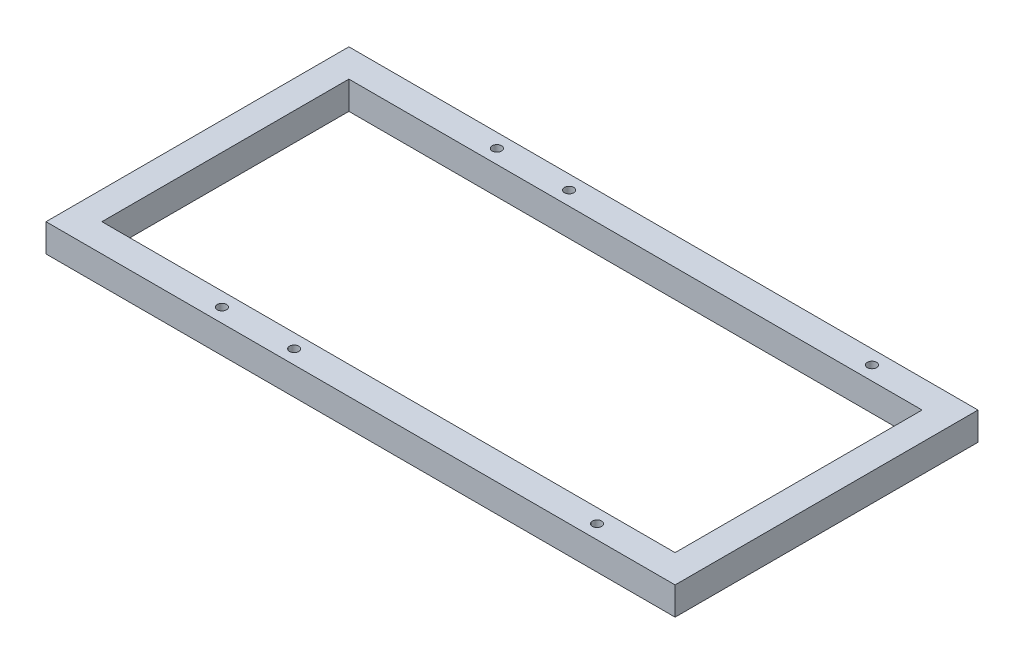
ISO-10303-21;
HEADER;
FILE_DESCRIPTION(('STEP AP214'),'2;1');
FILE_NAME('part.step','',(''),(''),'','','');
FILE_SCHEMA(('AUTOMOTIVE_DESIGN { 1 0 10303 214 1 1 1 1 }'));
ENDSEC;
DATA;
#1=APPLICATION_CONTEXT('core data for automotive mechanical design processes');
#2=APPLICATION_PROTOCOL_DEFINITION('international standard','automotive_design',2000,#1);
#3=PRODUCT_CONTEXT('',#1,'mechanical');
#4=PRODUCT('Part','Part','',(#3));
#5=PRODUCT_RELATED_PRODUCT_CATEGORY('part','',(#4));
#6=PRODUCT_DEFINITION_FORMATION('','',#4);
#7=PRODUCT_DEFINITION_CONTEXT('part definition',#1,'design');
#8=PRODUCT_DEFINITION('design','',#6,#7);
#9=PRODUCT_DEFINITION_SHAPE('','',#8);
#10=(LENGTH_UNIT() NAMED_UNIT(*) SI_UNIT(.MILLI.,.METRE.));
#11=(NAMED_UNIT(*) PLANE_ANGLE_UNIT() SI_UNIT($,.RADIAN.));
#12=(NAMED_UNIT(*) SI_UNIT($,.STERADIAN.) SOLID_ANGLE_UNIT());
#13=UNCERTAINTY_MEASURE_WITH_UNIT(LENGTH_MEASURE(1.E-05),#10,'distance_accuracy_value','');
#14=(GEOMETRIC_REPRESENTATION_CONTEXT(3) GLOBAL_UNCERTAINTY_ASSIGNED_CONTEXT((#13)) GLOBAL_UNIT_ASSIGNED_CONTEXT((#10,
#11,#12)) REPRESENTATION_CONTEXT('',''));
#15=CARTESIAN_POINT('',(0.,0.,0.));
#16=DIRECTION('',(0.,0.,1.));
#17=DIRECTION('',(1.,0.,0.));
#18=AXIS2_PLACEMENT_3D('',#15,#16,#17);
#19=CARTESIAN_POINT('',(0.,12.,0.));
#20=DIRECTION('',(0.,1.,0.));
#21=DIRECTION('',(0.,0.,1.));
#22=AXIS2_PLACEMENT_3D('',#19,#20,#21);
#23=PLANE('',#22);
#24=CARTESIAN_POINT('',(95.4999999999999,12.,-59.));
#25=DIRECTION('',(0.,-1.,0.));
#26=DIRECTION('',(0.,0.,-1.));
#27=AXIS2_PLACEMENT_3D('',#24,#25,#26);
#28=CIRCLE('',#27,2.);
#29=CARTESIAN_POINT('',(95.4999999999999,12.,-61.));
#30=VERTEX_POINT('',#29);
#31=EDGE_CURVE('E191',#30,#30,#28,.T.);
#32=ORIENTED_EDGE('',*,*,#31,.T.);
#33=EDGE_LOOP('',(#32));
#34=FACE_BOUND('',#33,.T.);
#35=CARTESIAN_POINT('',(95.4999999999999,12.,59.));
#36=DIRECTION('',(0.,1.,0.));
#37=DIRECTION('',(0.,0.,1.));
#38=AXIS2_PLACEMENT_3D('',#35,#36,#37);
#39=CIRCLE('',#38,2.);
#40=CARTESIAN_POINT('',(95.4999999999999,12.,61.));
#41=VERTEX_POINT('',#40);
#42=EDGE_CURVE('E181',#41,#41,#39,.T.);
#43=ORIENTED_EDGE('',*,*,#42,.F.);
#44=EDGE_LOOP('',(#43));
#45=FACE_BOUND('',#44,.T.);
#46=CARTESIAN_POINT('',(-34.5000000000001,12.,59.));
#47=DIRECTION('',(0.,1.,0.));
#48=DIRECTION('',(0.,0.,1.));
#49=AXIS2_PLACEMENT_3D('',#46,#47,#48);
#50=CIRCLE('',#49,2.);
#51=CARTESIAN_POINT('',(-34.5000000000001,12.,61.));
#52=VERTEX_POINT('',#51);
#53=EDGE_CURVE('E178',#52,#52,#50,.T.);
#54=ORIENTED_EDGE('',*,*,#53,.F.);
#55=EDGE_LOOP('',(#54));
#56=FACE_BOUND('',#55,.T.);
#57=CARTESIAN_POINT('',(-34.5000000000001,12.,-59.));
#58=DIRECTION('',(0.,-1.,0.));
#59=DIRECTION('',(0.,0.,-1.));
#60=AXIS2_PLACEMENT_3D('',#57,#58,#59);
#61=CIRCLE('',#60,2.);
#62=CARTESIAN_POINT('',(-34.5000000000001,12.,-61.));
#63=VERTEX_POINT('',#62);
#64=EDGE_CURVE('E175',#63,#63,#61,.T.);
#65=ORIENTED_EDGE('',*,*,#64,.T.);
#66=EDGE_LOOP('',(#65));
#67=FACE_BOUND('',#66,.T.);
#68=CARTESIAN_POINT('',(-65.5000000000001,12.,-59.));
#69=DIRECTION('',(0.,-1.,0.));
#70=DIRECTION('',(0.,0.,-1.));
#71=AXIS2_PLACEMENT_3D('',#68,#69,#70);
#72=CIRCLE('',#71,2.);
#73=CARTESIAN_POINT('',(-65.5000000000001,12.,-61.));
#74=VERTEX_POINT('',#73);
#75=EDGE_CURVE('E171',#74,#74,#72,.T.);
#76=ORIENTED_EDGE('',*,*,#75,.T.);
#77=EDGE_LOOP('',(#76));
#78=FACE_BOUND('',#77,.T.);
#79=CARTESIAN_POINT('',(-65.5000000000001,12.,59.));
#80=DIRECTION('',(0.,1.,0.));
#81=DIRECTION('',(0.,0.,1.));
#82=AXIS2_PLACEMENT_3D('',#79,#80,#81);
#83=CIRCLE('',#82,2.);
#84=CARTESIAN_POINT('',(-65.5000000000001,12.,61.));
#85=VERTEX_POINT('',#84);
#86=EDGE_CURVE('E167',#85,#85,#83,.T.);
#87=ORIENTED_EDGE('',*,*,#86,.F.);
#88=EDGE_LOOP('',(#87));
#89=FACE_BOUND('',#88,.T.);
#90=DIRECTION('',(0.,0.,-1.));
#91=VECTOR('',#90,1.);
#92=CARTESIAN_POINT('',(135.,12.,-65.));
#93=LINE('',#92,#91);
#94=CARTESIAN_POINT('',(135.,12.,65.));
#95=VERTEX_POINT('',#94);
#96=CARTESIAN_POINT('',(135.,12.,-65.));
#97=VERTEX_POINT('',#96);
#98=EDGE_CURVE('E140',#95,#97,#93,.T.);
#99=ORIENTED_EDGE('',*,*,#98,.T.);
#100=DIRECTION('',(-1.,0.,0.));
#101=VECTOR('',#100,1.);
#102=CARTESIAN_POINT('',(-135.,12.,-65.));
#103=LINE('',#102,#101);
#104=CARTESIAN_POINT('',(-135.,12.,-65.));
#105=VERTEX_POINT('',#104);
#106=EDGE_CURVE('E143',#97,#105,#103,.T.);
#107=ORIENTED_EDGE('',*,*,#106,.T.);
#108=DIRECTION('',(0.,0.,1.));
#109=VECTOR('',#108,1.);
#110=CARTESIAN_POINT('',(-135.,12.,-65.));
#111=LINE('',#110,#109);
#112=CARTESIAN_POINT('',(-135.,12.,65.));
#113=VERTEX_POINT('',#112);
#114=EDGE_CURVE('E146',#105,#113,#111,.T.);
#115=ORIENTED_EDGE('',*,*,#114,.T.);
#116=DIRECTION('',(1.,0.,0.));
#117=VECTOR('',#116,1.);
#118=CARTESIAN_POINT('',(-135.,12.,65.));
#119=LINE('',#118,#117);
#120=EDGE_CURVE('E148',#113,#95,#119,.T.);
#121=ORIENTED_EDGE('',*,*,#120,.T.);
#122=EDGE_LOOP('',(#99,#107,#115,#121));
#123=FACE_BOUND('',#122,.T.);
#124=DIRECTION('',(-1.,0.,0.));
#125=VECTOR('',#124,1.);
#126=CARTESIAN_POINT('',(-123.,12.,-53.));
#127=LINE('',#126,#125);
#128=CARTESIAN_POINT('',(123.,12.,-53.));
#129=VERTEX_POINT('',#128);
#130=CARTESIAN_POINT('',(-123.,12.,-53.));
#131=VERTEX_POINT('',#130);
#132=EDGE_CURVE('E110',#129,#131,#127,.T.);
#133=ORIENTED_EDGE('',*,*,#132,.F.);
#134=DIRECTION('',(0.,0.,-1.));
#135=VECTOR('',#134,1.);
#136=CARTESIAN_POINT('',(123.,12.,-53.));
#137=LINE('',#136,#135);
#138=CARTESIAN_POINT('',(123.,12.,53.));
#139=VERTEX_POINT('',#138);
#140=EDGE_CURVE('E102',#139,#129,#137,.T.);
#141=ORIENTED_EDGE('',*,*,#140,.F.);
#142=DIRECTION('',(1.,0.,0.));
#143=VECTOR('',#142,1.);
#144=CARTESIAN_POINT('',(-123.,12.,53.));
#145=LINE('',#144,#143);
#146=CARTESIAN_POINT('',(-123.,12.,53.));
#147=VERTEX_POINT('',#146);
#148=EDGE_CURVE('E124',#147,#139,#145,.T.);
#149=ORIENTED_EDGE('',*,*,#148,.F.);
#150=DIRECTION('',(0.,0.,1.));
#151=VECTOR('',#150,1.);
#152=CARTESIAN_POINT('',(-123.,12.,-53.));
#153=LINE('',#152,#151);
#154=EDGE_CURVE('E122',#131,#147,#153,.T.);
#155=ORIENTED_EDGE('',*,*,#154,.F.);
#156=EDGE_LOOP('',(#133,#141,#149,#155));
#157=FACE_BOUND('',#156,.T.);
#158=ADVANCED_FACE('F35',(#34,#45,#56,#67,#78,#89,#123,#157),#23,.T.);
#159=CARTESIAN_POINT('',(0.,0.,0.));
#160=DIRECTION('',(0.,1.,0.));
#161=DIRECTION('',(0.,0.,1.));
#162=AXIS2_PLACEMENT_3D('',#159,#160,#161);
#163=PLANE('',#162);
#164=CARTESIAN_POINT('',(95.4999999999999,0.,-59.));
#165=DIRECTION('',(0.,1.,0.));
#166=DIRECTION('',(0.,0.,1.));
#167=AXIS2_PLACEMENT_3D('',#164,#165,#166);
#168=CIRCLE('',#167,2.);
#169=CARTESIAN_POINT('',(95.4999999999999,0.,-57.));
#170=VERTEX_POINT('',#169);
#171=EDGE_CURVE('E39',#170,#170,#168,.F.);
#172=ORIENTED_EDGE('',*,*,#171,.F.);
#173=EDGE_LOOP('',(#172));
#174=FACE_BOUND('',#173,.T.);
#175=CARTESIAN_POINT('',(95.4999999999999,0.,59.));
#176=DIRECTION('',(0.,1.,0.));
#177=DIRECTION('',(0.,0.,1.));
#178=AXIS2_PLACEMENT_3D('',#175,#176,#177);
#179=CIRCLE('',#178,2.);
#180=CARTESIAN_POINT('',(95.4999999999999,0.,61.));
#181=VERTEX_POINT('',#180);
#182=EDGE_CURVE('E179',#181,#181,#179,.T.);
#183=ORIENTED_EDGE('',*,*,#182,.T.);
#184=EDGE_LOOP('',(#183));
#185=FACE_BOUND('',#184,.T.);
#186=CARTESIAN_POINT('',(-34.5000000000001,0.,59.));
#187=DIRECTION('',(0.,1.,0.));
#188=DIRECTION('',(0.,0.,1.));
#189=AXIS2_PLACEMENT_3D('',#186,#187,#188);
#190=CIRCLE('',#189,2.);
#191=CARTESIAN_POINT('',(-34.5000000000001,0.,61.));
#192=VERTEX_POINT('',#191);
#193=EDGE_CURVE('E176',#192,#192,#190,.T.);
#194=ORIENTED_EDGE('',*,*,#193,.T.);
#195=EDGE_LOOP('',(#194));
#196=FACE_BOUND('',#195,.T.);
#197=CARTESIAN_POINT('',(-34.5000000000001,0.,-59.));
#198=DIRECTION('',(0.,1.,0.));
#199=DIRECTION('',(0.,0.,1.));
#200=AXIS2_PLACEMENT_3D('',#197,#198,#199);
#201=CIRCLE('',#200,2.);
#202=CARTESIAN_POINT('',(-34.5000000000001,0.,-57.));
#203=VERTEX_POINT('',#202);
#204=EDGE_CURVE('E172',#203,#203,#201,.F.);
#205=ORIENTED_EDGE('',*,*,#204,.F.);
#206=EDGE_LOOP('',(#205));
#207=FACE_BOUND('',#206,.T.);
#208=CARTESIAN_POINT('',(-65.5000000000001,0.,-59.));
#209=DIRECTION('',(0.,1.,0.));
#210=DIRECTION('',(0.,0.,1.));
#211=AXIS2_PLACEMENT_3D('',#208,#209,#210);
#212=CIRCLE('',#211,2.);
#213=CARTESIAN_POINT('',(-65.5000000000001,0.,-57.));
#214=VERTEX_POINT('',#213);
#215=EDGE_CURVE('E168',#214,#214,#212,.F.);
#216=ORIENTED_EDGE('',*,*,#215,.F.);
#217=EDGE_LOOP('',(#216));
#218=FACE_BOUND('',#217,.T.);
#219=CARTESIAN_POINT('',(-65.5000000000001,0.,59.));
#220=DIRECTION('',(0.,1.,0.));
#221=DIRECTION('',(0.,0.,1.));
#222=AXIS2_PLACEMENT_3D('',#219,#220,#221);
#223=CIRCLE('',#222,2.);
#224=CARTESIAN_POINT('',(-65.5000000000001,0.,61.));
#225=VERTEX_POINT('',#224);
#226=EDGE_CURVE('E130',#225,#225,#223,.T.);
#227=ORIENTED_EDGE('',*,*,#226,.T.);
#228=EDGE_LOOP('',(#227));
#229=FACE_BOUND('',#228,.T.);
#230=DIRECTION('',(0.,0.,-1.));
#231=VECTOR('',#230,1.);
#232=CARTESIAN_POINT('',(135.,0.,-65.));
#233=LINE('',#232,#231);
#234=CARTESIAN_POINT('',(135.,0.,65.));
#235=VERTEX_POINT('',#234);
#236=CARTESIAN_POINT('',(135.,0.,-65.));
#237=VERTEX_POINT('',#236);
#238=EDGE_CURVE('E118',#235,#237,#233,.T.);
#239=ORIENTED_EDGE('',*,*,#238,.F.);
#240=DIRECTION('',(1.,0.,0.));
#241=VECTOR('',#240,1.);
#242=CARTESIAN_POINT('',(-135.,0.,65.));
#243=LINE('',#242,#241);
#244=CARTESIAN_POINT('',(-135.,0.,65.));
#245=VERTEX_POINT('',#244);
#246=EDGE_CURVE('E144',#245,#235,#243,.T.);
#247=ORIENTED_EDGE('',*,*,#246,.F.);
#248=DIRECTION('',(0.,0.,1.));
#249=VECTOR('',#248,1.);
#250=CARTESIAN_POINT('',(-135.,0.,-65.));
#251=LINE('',#250,#249);
#252=CARTESIAN_POINT('',(-135.,0.,-65.));
#253=VERTEX_POINT('',#252);
#254=EDGE_CURVE('E155',#253,#245,#251,.T.);
#255=ORIENTED_EDGE('',*,*,#254,.F.);
#256=DIRECTION('',(-1.,0.,0.));
#257=VECTOR('',#256,1.);
#258=CARTESIAN_POINT('',(-135.,0.,-65.));
#259=LINE('',#258,#257);
#260=EDGE_CURVE('E153',#237,#253,#259,.T.);
#261=ORIENTED_EDGE('',*,*,#260,.F.);
#262=EDGE_LOOP('',(#239,#247,#255,#261));
#263=FACE_BOUND('',#262,.T.);
#264=DIRECTION('',(0.,0.,-1.));
#265=VECTOR('',#264,1.);
#266=CARTESIAN_POINT('',(123.,0.,-53.));
#267=LINE('',#266,#265);
#268=CARTESIAN_POINT('',(123.,0.,53.));
#269=VERTEX_POINT('',#268);
#270=CARTESIAN_POINT('',(123.,0.,-53.));
#271=VERTEX_POINT('',#270);
#272=EDGE_CURVE('E60',#269,#271,#267,.T.);
#273=ORIENTED_EDGE('',*,*,#272,.T.);
#274=DIRECTION('',(-1.,0.,0.));
#275=VECTOR('',#274,1.);
#276=CARTESIAN_POINT('',(-123.,0.,-53.));
#277=LINE('',#276,#275);
#278=CARTESIAN_POINT('',(-123.,0.,-53.));
#279=VERTEX_POINT('',#278);
#280=EDGE_CURVE('E117',#271,#279,#277,.T.);
#281=ORIENTED_EDGE('',*,*,#280,.T.);
#282=DIRECTION('',(0.,0.,1.));
#283=VECTOR('',#282,1.);
#284=CARTESIAN_POINT('',(-123.,0.,-53.));
#285=LINE('',#284,#283);
#286=CARTESIAN_POINT('',(-123.,0.,53.));
#287=VERTEX_POINT('',#286);
#288=EDGE_CURVE('E132',#279,#287,#285,.T.);
#289=ORIENTED_EDGE('',*,*,#288,.T.);
#290=DIRECTION('',(1.,0.,0.));
#291=VECTOR('',#290,1.);
#292=CARTESIAN_POINT('',(-123.,0.,53.));
#293=LINE('',#292,#291);
#294=EDGE_CURVE('E111',#287,#269,#293,.T.);
#295=ORIENTED_EDGE('',*,*,#294,.T.);
#296=EDGE_LOOP('',(#273,#281,#289,#295));
#297=FACE_BOUND('',#296,.T.);
#298=ADVANCED_FACE('F205',(#174,#185,#196,#207,#218,#229,#263,#297),#163,.F.);
#299=CARTESIAN_POINT('',(135.,12.,-65.));
#300=DIRECTION('',(-1.,0.,0.));
#301=DIRECTION('',(0.,0.,1.));
#302=AXIS2_PLACEMENT_3D('',#299,#300,#301);
#303=PLANE('',#302);
#304=ORIENTED_EDGE('',*,*,#238,.T.);
#305=DIRECTION('',(0.,-1.,0.));
#306=VECTOR('',#305,1.);
#307=CARTESIAN_POINT('',(135.,12.,-65.));
#308=LINE('',#307,#306);
#309=EDGE_CURVE('E11',#97,#237,#308,.T.);
#310=ORIENTED_EDGE('',*,*,#309,.F.);
#311=ORIENTED_EDGE('',*,*,#98,.F.);
#312=DIRECTION('',(0.,-1.,0.));
#313=VECTOR('',#312,1.);
#314=CARTESIAN_POINT('',(135.,12.,65.));
#315=LINE('',#314,#313);
#316=EDGE_CURVE('E150',#95,#235,#315,.T.);
#317=ORIENTED_EDGE('',*,*,#316,.T.);
#318=EDGE_LOOP('',(#304,#310,#311,#317));
#319=FACE_BOUND('',#318,.T.);
#320=ADVANCED_FACE('F37',(#319),#303,.F.);
#321=CARTESIAN_POINT('',(-135.,12.,-65.));
#322=DIRECTION('',(0.,0.,1.));
#323=DIRECTION('',(1.,0.,0.));
#324=AXIS2_PLACEMENT_3D('',#321,#322,#323);
#325=PLANE('',#324);
#326=ORIENTED_EDGE('',*,*,#260,.T.);
#327=DIRECTION('',(0.,-1.,0.));
#328=VECTOR('',#327,1.);
#329=CARTESIAN_POINT('',(-135.,12.,-65.));
#330=LINE('',#329,#328);
#331=EDGE_CURVE('E44',#105,#253,#330,.T.);
#332=ORIENTED_EDGE('',*,*,#331,.F.);
#333=ORIENTED_EDGE('',*,*,#106,.F.);
#334=ORIENTED_EDGE('',*,*,#309,.T.);
#335=EDGE_LOOP('',(#326,#332,#333,#334));
#336=FACE_BOUND('',#335,.T.);
#337=ADVANCED_FACE('F216',(#336),#325,.F.);
#338=CARTESIAN_POINT('',(-135.,12.,-65.));
#339=DIRECTION('',(1.,0.,0.));
#340=DIRECTION('',(0.,0.,-1.));
#341=AXIS2_PLACEMENT_3D('',#338,#339,#340);
#342=PLANE('',#341);
#343=ORIENTED_EDGE('',*,*,#254,.T.);
#344=DIRECTION('',(0.,-1.,0.));
#345=VECTOR('',#344,1.);
#346=CARTESIAN_POINT('',(-135.,12.,65.));
#347=LINE('',#346,#345);
#348=EDGE_CURVE('E160',#113,#245,#347,.T.);
#349=ORIENTED_EDGE('',*,*,#348,.F.);
#350=ORIENTED_EDGE('',*,*,#114,.F.);
#351=ORIENTED_EDGE('',*,*,#331,.T.);
#352=EDGE_LOOP('',(#343,#349,#350,#351));
#353=FACE_BOUND('',#352,.T.);
#354=ADVANCED_FACE('F221',(#353),#342,.F.);
#355=CARTESIAN_POINT('',(-135.,12.,65.));
#356=DIRECTION('',(0.,0.,-1.));
#357=DIRECTION('',(-1.,0.,0.));
#358=AXIS2_PLACEMENT_3D('',#355,#356,#357);
#359=PLANE('',#358);
#360=ORIENTED_EDGE('',*,*,#246,.T.);
#361=ORIENTED_EDGE('',*,*,#316,.F.);
#362=ORIENTED_EDGE('',*,*,#120,.F.);
#363=ORIENTED_EDGE('',*,*,#348,.T.);
#364=EDGE_LOOP('',(#360,#361,#362,#363));
#365=FACE_BOUND('',#364,.T.);
#366=ADVANCED_FACE('F224',(#365),#359,.F.);
#367=CARTESIAN_POINT('',(123.,12.,-53.));
#368=DIRECTION('',(-1.,0.,0.));
#369=DIRECTION('',(0.,0.,1.));
#370=AXIS2_PLACEMENT_3D('',#367,#368,#369);
#371=PLANE('',#370);
#372=ORIENTED_EDGE('',*,*,#272,.F.);
#373=DIRECTION('',(0.,-1.,0.));
#374=VECTOR('',#373,1.);
#375=CARTESIAN_POINT('',(123.,12.,53.));
#376=LINE('',#375,#374);
#377=EDGE_CURVE('E106',#139,#269,#376,.T.);
#378=ORIENTED_EDGE('',*,*,#377,.F.);
#379=ORIENTED_EDGE('',*,*,#140,.T.);
#380=DIRECTION('',(0.,-1.,0.));
#381=VECTOR('',#380,1.);
#382=CARTESIAN_POINT('',(123.,12.,-53.));
#383=LINE('',#382,#381);
#384=EDGE_CURVE('E105',#129,#271,#383,.T.);
#385=ORIENTED_EDGE('',*,*,#384,.T.);
#386=EDGE_LOOP('',(#372,#378,#379,#385));
#387=FACE_BOUND('',#386,.T.);
#388=ADVANCED_FACE('F104',(#387),#371,.T.);
#389=CARTESIAN_POINT('',(-123.,12.,-53.));
#390=DIRECTION('',(0.,0.,1.));
#391=DIRECTION('',(1.,0.,0.));
#392=AXIS2_PLACEMENT_3D('',#389,#390,#391);
#393=PLANE('',#392);
#394=ORIENTED_EDGE('',*,*,#280,.F.);
#395=ORIENTED_EDGE('',*,*,#384,.F.);
#396=ORIENTED_EDGE('',*,*,#132,.T.);
#397=DIRECTION('',(0.,-1.,0.));
#398=VECTOR('',#397,1.);
#399=CARTESIAN_POINT('',(-123.,12.,-53.));
#400=LINE('',#399,#398);
#401=EDGE_CURVE('E119',#131,#279,#400,.T.);
#402=ORIENTED_EDGE('',*,*,#401,.T.);
#403=EDGE_LOOP('',(#394,#395,#396,#402));
#404=FACE_BOUND('',#403,.T.);
#405=ADVANCED_FACE('F114',(#404),#393,.T.);
#406=CARTESIAN_POINT('',(-123.,12.,-53.));
#407=DIRECTION('',(1.,0.,0.));
#408=DIRECTION('',(0.,0.,-1.));
#409=AXIS2_PLACEMENT_3D('',#406,#407,#408);
#410=PLANE('',#409);
#411=ORIENTED_EDGE('',*,*,#288,.F.);
#412=ORIENTED_EDGE('',*,*,#401,.F.);
#413=ORIENTED_EDGE('',*,*,#154,.T.);
#414=DIRECTION('',(0.,-1.,0.));
#415=VECTOR('',#414,1.);
#416=CARTESIAN_POINT('',(-123.,12.,53.));
#417=LINE('',#416,#415);
#418=EDGE_CURVE('E52',#147,#287,#417,.T.);
#419=ORIENTED_EDGE('',*,*,#418,.T.);
#420=EDGE_LOOP('',(#411,#412,#413,#419));
#421=FACE_BOUND('',#420,.T.);
#422=ADVANCED_FACE('F233',(#421),#410,.T.);
#423=CARTESIAN_POINT('',(-123.,12.,53.));
#424=DIRECTION('',(0.,0.,-1.));
#425=DIRECTION('',(-1.,0.,0.));
#426=AXIS2_PLACEMENT_3D('',#423,#424,#425);
#427=PLANE('',#426);
#428=ORIENTED_EDGE('',*,*,#294,.F.);
#429=ORIENTED_EDGE('',*,*,#418,.F.);
#430=ORIENTED_EDGE('',*,*,#148,.T.);
#431=ORIENTED_EDGE('',*,*,#377,.T.);
#432=EDGE_LOOP('',(#428,#429,#430,#431));
#433=FACE_BOUND('',#432,.T.);
#434=ADVANCED_FACE('F231',(#433),#427,.T.);
#435=CARTESIAN_POINT('',(-65.5000000000001,-38.25,59.));
#436=DIRECTION('',(0.,1.,0.));
#437=DIRECTION('',(0.,0.,1.));
#438=AXIS2_PLACEMENT_3D('',#435,#436,#437);
#439=CYLINDRICAL_SURFACE('',#438,2.);
#440=ORIENTED_EDGE('',*,*,#86,.T.);
#441=EDGE_LOOP('',(#440));
#442=FACE_BOUND('',#441,.T.);
#443=ORIENTED_EDGE('',*,*,#226,.F.);
#444=EDGE_LOOP('',(#443));
#445=FACE_BOUND('',#444,.T.);
#446=ADVANCED_FACE('F200',(#442,#445),#439,.F.);
#447=CARTESIAN_POINT('',(-65.5000000000001,-38.25,-59.));
#448=DIRECTION('',(0.,1.,0.));
#449=DIRECTION('',(0.,0.,1.));
#450=AXIS2_PLACEMENT_3D('',#447,#448,#449);
#451=CYLINDRICAL_SURFACE('',#450,2.);
#452=ORIENTED_EDGE('',*,*,#75,.F.);
#453=EDGE_LOOP('',(#452));
#454=FACE_BOUND('',#453,.T.);
#455=ORIENTED_EDGE('',*,*,#215,.T.);
#456=EDGE_LOOP('',(#455));
#457=FACE_BOUND('',#456,.T.);
#458=ADVANCED_FACE('F239',(#454,#457),#451,.F.);
#459=CARTESIAN_POINT('',(-34.5000000000001,-38.25,-59.));
#460=DIRECTION('',(0.,1.,0.));
#461=DIRECTION('',(0.,0.,1.));
#462=AXIS2_PLACEMENT_3D('',#459,#460,#461);
#463=CYLINDRICAL_SURFACE('',#462,2.);
#464=ORIENTED_EDGE('',*,*,#64,.F.);
#465=EDGE_LOOP('',(#464));
#466=FACE_BOUND('',#465,.T.);
#467=ORIENTED_EDGE('',*,*,#204,.T.);
#468=EDGE_LOOP('',(#467));
#469=FACE_BOUND('',#468,.T.);
#470=ADVANCED_FACE('F291',(#466,#469),#463,.F.);
#471=CARTESIAN_POINT('',(-34.5000000000001,-38.25,59.));
#472=DIRECTION('',(0.,1.,0.));
#473=DIRECTION('',(0.,0.,1.));
#474=AXIS2_PLACEMENT_3D('',#471,#472,#473);
#475=CYLINDRICAL_SURFACE('',#474,2.);
#476=ORIENTED_EDGE('',*,*,#53,.T.);
#477=EDGE_LOOP('',(#476));
#478=FACE_BOUND('',#477,.T.);
#479=ORIENTED_EDGE('',*,*,#193,.F.);
#480=EDGE_LOOP('',(#479));
#481=FACE_BOUND('',#480,.T.);
#482=ADVANCED_FACE('F280',(#478,#481),#475,.F.);
#483=CARTESIAN_POINT('',(95.4999999999999,-38.25,59.));
#484=DIRECTION('',(0.,1.,0.));
#485=DIRECTION('',(0.,0.,1.));
#486=AXIS2_PLACEMENT_3D('',#483,#484,#485);
#487=CYLINDRICAL_SURFACE('',#486,2.);
#488=ORIENTED_EDGE('',*,*,#42,.T.);
#489=EDGE_LOOP('',(#488));
#490=FACE_BOUND('',#489,.T.);
#491=ORIENTED_EDGE('',*,*,#182,.F.);
#492=EDGE_LOOP('',(#491));
#493=FACE_BOUND('',#492,.T.);
#494=ADVANCED_FACE('F274',(#490,#493),#487,.F.);
#495=CARTESIAN_POINT('',(95.4999999999999,-38.25,-59.));
#496=DIRECTION('',(0.,1.,0.));
#497=DIRECTION('',(0.,0.,1.));
#498=AXIS2_PLACEMENT_3D('',#495,#496,#497);
#499=CYLINDRICAL_SURFACE('',#498,2.);
#500=ORIENTED_EDGE('',*,*,#31,.F.);
#501=EDGE_LOOP('',(#500));
#502=FACE_BOUND('',#501,.T.);
#503=ORIENTED_EDGE('',*,*,#171,.T.);
#504=EDGE_LOOP('',(#503));
#505=FACE_BOUND('',#504,.T.);
#506=ADVANCED_FACE('F279',(#502,#505),#499,.F.);
#507=CLOSED_SHELL('',(#158,#298,#320,#337,#354,#366,#388,#405,#422,#434,#446,#458,#470,#482,
#494,#506));
#508=MANIFOLD_SOLID_BREP('B2',#507);
#509=ADVANCED_BREP_SHAPE_REPRESENTATION('',(#18,#508),#14);
#510=SHAPE_DEFINITION_REPRESENTATION(#9,#509);
ENDSEC;
END-ISO-10303-21;
